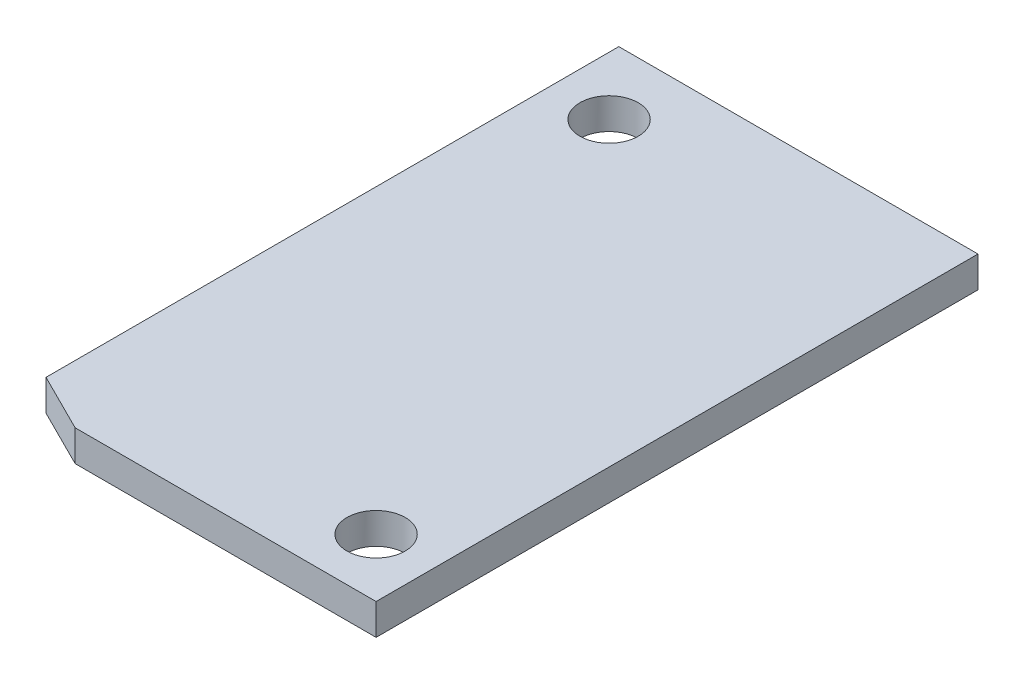
ISO-10303-21;
HEADER;
FILE_DESCRIPTION(('STEP AP214'),'2;1');
FILE_NAME('part.step','',(''),(''),'','','');
FILE_SCHEMA(('AUTOMOTIVE_DESIGN { 1 0 10303 214 1 1 1 1 }'));
ENDSEC;
DATA;
#1=APPLICATION_CONTEXT('core data for automotive mechanical design processes');
#2=APPLICATION_PROTOCOL_DEFINITION('international standard','automotive_design',2000,#1);
#3=PRODUCT_CONTEXT('',#1,'mechanical');
#4=PRODUCT('Part','Part','',(#3));
#5=PRODUCT_RELATED_PRODUCT_CATEGORY('part','',(#4));
#6=PRODUCT_DEFINITION_FORMATION('','',#4);
#7=PRODUCT_DEFINITION_CONTEXT('part definition',#1,'design');
#8=PRODUCT_DEFINITION('design','',#6,#7);
#9=PRODUCT_DEFINITION_SHAPE('','',#8);
#10=(LENGTH_UNIT() NAMED_UNIT(*) SI_UNIT(.MILLI.,.METRE.));
#11=(NAMED_UNIT(*) PLANE_ANGLE_UNIT() SI_UNIT($,.RADIAN.));
#12=(NAMED_UNIT(*) SI_UNIT($,.STERADIAN.) SOLID_ANGLE_UNIT());
#13=UNCERTAINTY_MEASURE_WITH_UNIT(LENGTH_MEASURE(1.E-05),#10,'distance_accuracy_value','');
#14=(GEOMETRIC_REPRESENTATION_CONTEXT(3) GLOBAL_UNCERTAINTY_ASSIGNED_CONTEXT((#13)) GLOBAL_UNIT_ASSIGNED_CONTEXT((#10,
#11,#12)) REPRESENTATION_CONTEXT('',''));
#15=CARTESIAN_POINT('',(0.,0.,0.));
#16=DIRECTION('',(0.,0.,1.));
#17=DIRECTION('',(1.,0.,0.));
#18=AXIS2_PLACEMENT_3D('',#15,#16,#17);
#19=CARTESIAN_POINT('',(9.25,1.6,15.5));
#20=DIRECTION('',(-1.,0.,0.));
#21=DIRECTION('',(0.,0.,1.));
#22=AXIS2_PLACEMENT_3D('',#19,#20,#21);
#23=PLANE('',#22);
#24=DIRECTION('',(0.,0.,-1.));
#25=VECTOR('',#24,1.);
#26=CARTESIAN_POINT('',(9.25,0.,15.5));
#27=LINE('',#26,#25);
#28=CARTESIAN_POINT('',(9.25,0.,15.5));
#29=VERTEX_POINT('',#28);
#30=CARTESIAN_POINT('',(9.25,0.,-15.5));
#31=VERTEX_POINT('',#30);
#32=EDGE_CURVE('E106',#29,#31,#27,.T.);
#33=ORIENTED_EDGE('',*,*,#32,.T.);
#34=DIRECTION('',(0.,-1.,0.));
#35=VECTOR('',#34,1.);
#36=CARTESIAN_POINT('',(9.25,1.6,-15.5));
#37=LINE('',#36,#35);
#38=CARTESIAN_POINT('',(9.25,1.6,-15.5));
#39=VERTEX_POINT('',#38);
#40=EDGE_CURVE('E11',#39,#31,#37,.T.);
#41=ORIENTED_EDGE('',*,*,#40,.F.);
#42=DIRECTION('',(0.,0.,-1.));
#43=VECTOR('',#42,1.);
#44=CARTESIAN_POINT('',(9.25,1.6,15.5));
#45=LINE('',#44,#43);
#46=CARTESIAN_POINT('',(9.25,1.6,15.5));
#47=VERTEX_POINT('',#46);
#48=EDGE_CURVE('E115',#47,#39,#45,.T.);
#49=ORIENTED_EDGE('',*,*,#48,.F.);
#50=DIRECTION('',(0.,-1.,0.));
#51=VECTOR('',#50,1.);
#52=CARTESIAN_POINT('',(9.25,1.6,15.5));
#53=LINE('',#52,#51);
#54=EDGE_CURVE('E102',#47,#29,#53,.T.);
#55=ORIENTED_EDGE('',*,*,#54,.T.);
#56=EDGE_LOOP('',(#33,#41,#49,#55));
#57=FACE_BOUND('',#56,.T.);
#58=ADVANCED_FACE('F31',(#57),#23,.F.);
#59=CARTESIAN_POINT('',(-9.25,1.6,-15.5));
#60=DIRECTION('',(0.,0.,1.));
#61=DIRECTION('',(1.,0.,0.));
#62=AXIS2_PLACEMENT_3D('',#59,#60,#61);
#63=PLANE('',#62);
#64=DIRECTION('',(-1.,0.,0.));
#65=VECTOR('',#64,1.);
#66=CARTESIAN_POINT('',(-9.25,0.,-15.5));
#67=LINE('',#66,#65);
#68=CARTESIAN_POINT('',(-9.25,0.,-15.5));
#69=VERTEX_POINT('',#68);
#70=EDGE_CURVE('E109',#31,#69,#67,.T.);
#71=ORIENTED_EDGE('',*,*,#70,.T.);
#72=DIRECTION('',(0.,-1.,0.));
#73=VECTOR('',#72,1.);
#74=CARTESIAN_POINT('',(-9.25,1.6,-15.5));
#75=LINE('',#74,#73);
#76=CARTESIAN_POINT('',(-9.25,1.6,-15.5));
#77=VERTEX_POINT('',#76);
#78=EDGE_CURVE('E40',#77,#69,#75,.T.);
#79=ORIENTED_EDGE('',*,*,#78,.F.);
#80=DIRECTION('',(-1.,0.,0.));
#81=VECTOR('',#80,1.);
#82=CARTESIAN_POINT('',(-9.25,1.6,-15.5));
#83=LINE('',#82,#81);
#84=EDGE_CURVE('E82',#39,#77,#83,.T.);
#85=ORIENTED_EDGE('',*,*,#84,.F.);
#86=ORIENTED_EDGE('',*,*,#40,.T.);
#87=EDGE_LOOP('',(#71,#79,#85,#86));
#88=FACE_BOUND('',#87,.T.);
#89=ADVANCED_FACE('F136',(#88),#63,.F.);
#90=CARTESIAN_POINT('',(-9.25,1.6,14.));
#91=DIRECTION('',(1.,0.,0.));
#92=DIRECTION('',(0.,0.,-1.));
#93=AXIS2_PLACEMENT_3D('',#90,#91,#92);
#94=PLANE('',#93);
#95=DIRECTION('',(0.,0.,1.));
#96=VECTOR('',#95,1.);
#97=CARTESIAN_POINT('',(-9.25,0.,14.));
#98=LINE('',#97,#96);
#99=CARTESIAN_POINT('',(-9.25,0.,14.));
#100=VERTEX_POINT('',#99);
#101=EDGE_CURVE('E97',#69,#100,#98,.T.);
#102=ORIENTED_EDGE('',*,*,#101,.T.);
#103=DIRECTION('',(0.,-1.,0.));
#104=VECTOR('',#103,1.);
#105=CARTESIAN_POINT('',(-9.25,1.6,14.));
#106=LINE('',#105,#104);
#107=CARTESIAN_POINT('',(-9.25,1.6,14.));
#108=VERTEX_POINT('',#107);
#109=EDGE_CURVE('E94',#108,#100,#106,.T.);
#110=ORIENTED_EDGE('',*,*,#109,.F.);
#111=DIRECTION('',(0.,0.,1.));
#112=VECTOR('',#111,1.);
#113=CARTESIAN_POINT('',(-9.25,1.6,14.));
#114=LINE('',#113,#112);
#115=EDGE_CURVE('E86',#77,#108,#114,.T.);
#116=ORIENTED_EDGE('',*,*,#115,.F.);
#117=ORIENTED_EDGE('',*,*,#78,.T.);
#118=EDGE_LOOP('',(#102,#110,#116,#117));
#119=FACE_BOUND('',#118,.T.);
#120=ADVANCED_FACE('F95',(#119),#94,.F.);
#121=CARTESIAN_POINT('',(-9.25,1.6,14.));
#122=DIRECTION('',(0.447213595499958,0.,-0.894427190999916));
#123=DIRECTION('',(-0.894427190999916,0.,-0.447213595499958));
#124=AXIS2_PLACEMENT_3D('',#121,#122,#123);
#125=PLANE('',#124);
#126=DIRECTION('',(0.894427190999916,0.,0.447213595499958));
#127=VECTOR('',#126,1.);
#128=CARTESIAN_POINT('',(-9.25,0.,14.));
#129=LINE('',#128,#127);
#130=CARTESIAN_POINT('',(-6.25,0.,15.5));
#131=VERTEX_POINT('',#130);
#132=EDGE_CURVE('E68',#100,#131,#129,.T.);
#133=ORIENTED_EDGE('',*,*,#132,.T.);
#134=DIRECTION('',(0.,-1.,0.));
#135=VECTOR('',#134,1.);
#136=CARTESIAN_POINT('',(-6.25,1.6,15.5));
#137=LINE('',#136,#135);
#138=CARTESIAN_POINT('',(-6.25,1.6,15.5));
#139=VERTEX_POINT('',#138);
#140=EDGE_CURVE('E98',#139,#131,#137,.T.);
#141=ORIENTED_EDGE('',*,*,#140,.F.);
#142=DIRECTION('',(0.894427190999916,0.,0.447213595499958));
#143=VECTOR('',#142,1.);
#144=CARTESIAN_POINT('',(-9.25,1.6,14.));
#145=LINE('',#144,#143);
#146=EDGE_CURVE('E90',#108,#139,#145,.T.);
#147=ORIENTED_EDGE('',*,*,#146,.F.);
#148=ORIENTED_EDGE('',*,*,#109,.T.);
#149=EDGE_LOOP('',(#133,#141,#147,#148));
#150=FACE_BOUND('',#149,.T.);
#151=ADVANCED_FACE('F100',(#150),#125,.F.);
#152=CARTESIAN_POINT('',(-6.25,1.6,15.5));
#153=DIRECTION('',(0.,0.,-1.));
#154=DIRECTION('',(-1.,0.,0.));
#155=AXIS2_PLACEMENT_3D('',#152,#153,#154);
#156=PLANE('',#155);
#157=DIRECTION('',(1.,0.,0.));
#158=VECTOR('',#157,1.);
#159=CARTESIAN_POINT('',(-6.25,0.,15.5));
#160=LINE('',#159,#158);
#161=EDGE_CURVE('E74',#131,#29,#160,.T.);
#162=ORIENTED_EDGE('',*,*,#161,.T.);
#163=ORIENTED_EDGE('',*,*,#54,.F.);
#164=DIRECTION('',(1.,0.,0.));
#165=VECTOR('',#164,1.);
#166=CARTESIAN_POINT('',(-6.25,1.6,15.5));
#167=LINE('',#166,#165);
#168=EDGE_CURVE('E48',#139,#47,#167,.T.);
#169=ORIENTED_EDGE('',*,*,#168,.F.);
#170=ORIENTED_EDGE('',*,*,#140,.T.);
#171=EDGE_LOOP('',(#162,#163,#169,#170));
#172=FACE_BOUND('',#171,.T.);
#173=ADVANCED_FACE('F124',(#172),#156,.F.);
#174=CARTESIAN_POINT('',(9.25,1.6,-15.5));
#175=DIRECTION('',(0.,-1.,0.));
#176=DIRECTION('',(0.,0.,-1.));
#177=AXIS2_PLACEMENT_3D('',#174,#175,#176);
#178=PLANE('',#177);
#179=CARTESIAN_POINT('',(6.25,1.6,12.5));
#180=DIRECTION('',(0.,1.,0.));
#181=DIRECTION('',(0.,0.,1.));
#182=AXIS2_PLACEMENT_3D('',#179,#180,#181);
#183=CIRCLE('',#182,1.49999999999999);
#184=CARTESIAN_POINT('',(6.25,1.6,14.));
#185=VERTEX_POINT('',#184);
#186=EDGE_CURVE('E197',#185,#185,#183,.T.);
#187=ORIENTED_EDGE('',*,*,#186,.F.);
#188=EDGE_LOOP('',(#187));
#189=FACE_BOUND('',#188,.T.);
#190=CARTESIAN_POINT('',(-6.25,1.6,-12.));
#191=DIRECTION('',(0.,1.,0.));
#192=DIRECTION('',(0.,0.,1.));
#193=AXIS2_PLACEMENT_3D('',#190,#191,#192);
#194=CIRCLE('',#193,1.49999999999999);
#195=CARTESIAN_POINT('',(-6.25,1.6,-10.5));
#196=VERTEX_POINT('',#195);
#197=EDGE_CURVE('E199',#196,#196,#194,.T.);
#198=ORIENTED_EDGE('',*,*,#197,.F.);
#199=EDGE_LOOP('',(#198));
#200=FACE_BOUND('',#199,.T.);
#201=ORIENTED_EDGE('',*,*,#48,.T.);
#202=ORIENTED_EDGE('',*,*,#84,.T.);
#203=ORIENTED_EDGE('',*,*,#115,.T.);
#204=ORIENTED_EDGE('',*,*,#146,.T.);
#205=ORIENTED_EDGE('',*,*,#168,.T.);
#206=EDGE_LOOP('',(#201,#202,#203,#204,#205));
#207=FACE_BOUND('',#206,.T.);
#208=ADVANCED_FACE('F88',(#189,#200,#207),#178,.F.);
#209=CARTESIAN_POINT('',(9.25,0.,-15.5));
#210=DIRECTION('',(0.,-1.,0.));
#211=DIRECTION('',(0.,0.,-1.));
#212=AXIS2_PLACEMENT_3D('',#209,#210,#211);
#213=PLANE('',#212);
#214=CARTESIAN_POINT('',(6.25,0.,12.5));
#215=DIRECTION('',(0.,-1.,0.));
#216=DIRECTION('',(0.,0.,-1.));
#217=AXIS2_PLACEMENT_3D('',#214,#215,#216);
#218=CIRCLE('',#217,1.49999999999999);
#219=CARTESIAN_POINT('',(6.25,0.,11.));
#220=VERTEX_POINT('',#219);
#221=EDGE_CURVE('E34',#220,#220,#218,.T.);
#222=ORIENTED_EDGE('',*,*,#221,.F.);
#223=EDGE_LOOP('',(#222));
#224=FACE_BOUND('',#223,.T.);
#225=CARTESIAN_POINT('',(-6.25,0.,-12.));
#226=DIRECTION('',(0.,-1.,0.));
#227=DIRECTION('',(0.,0.,-1.));
#228=AXIS2_PLACEMENT_3D('',#225,#226,#227);
#229=CIRCLE('',#228,1.49999999999999);
#230=CARTESIAN_POINT('',(-6.25,0.,-13.5));
#231=VERTEX_POINT('',#230);
#232=EDGE_CURVE('E110',#231,#231,#229,.T.);
#233=ORIENTED_EDGE('',*,*,#232,.F.);
#234=EDGE_LOOP('',(#233));
#235=FACE_BOUND('',#234,.T.);
#236=ORIENTED_EDGE('',*,*,#32,.F.);
#237=ORIENTED_EDGE('',*,*,#161,.F.);
#238=ORIENTED_EDGE('',*,*,#132,.F.);
#239=ORIENTED_EDGE('',*,*,#101,.F.);
#240=ORIENTED_EDGE('',*,*,#70,.F.);
#241=EDGE_LOOP('',(#236,#237,#238,#239,#240));
#242=FACE_BOUND('',#241,.T.);
#243=ADVANCED_FACE('F120',(#224,#235,#242),#213,.T.);
#244=CARTESIAN_POINT('',(-6.25,1.6,-12.));
#245=DIRECTION('',(0.,1.,0.));
#246=DIRECTION('',(0.,0.,1.));
#247=AXIS2_PLACEMENT_3D('',#244,#245,#246);
#248=CYLINDRICAL_SURFACE('',#247,1.49999999999999);
#249=ORIENTED_EDGE('',*,*,#232,.T.);
#250=EDGE_LOOP('',(#249));
#251=FACE_BOUND('',#250,.T.);
#252=ORIENTED_EDGE('',*,*,#197,.T.);
#253=EDGE_LOOP('',(#252));
#254=FACE_BOUND('',#253,.T.);
#255=ADVANCED_FACE('F169',(#251,#254),#248,.F.);
#256=CARTESIAN_POINT('',(6.25,1.6,12.5));
#257=DIRECTION('',(0.,1.,0.));
#258=DIRECTION('',(0.,0.,1.));
#259=AXIS2_PLACEMENT_3D('',#256,#257,#258);
#260=CYLINDRICAL_SURFACE('',#259,1.49999999999999);
#261=ORIENTED_EDGE('',*,*,#221,.T.);
#262=EDGE_LOOP('',(#261));
#263=FACE_BOUND('',#262,.T.);
#264=ORIENTED_EDGE('',*,*,#186,.T.);
#265=EDGE_LOOP('',(#264));
#266=FACE_BOUND('',#265,.T.);
#267=ADVANCED_FACE('F178',(#263,#266),#260,.F.);
#268=CLOSED_SHELL('',(#58,#89,#120,#151,#173,#208,#243,#255,#267));
#269=MANIFOLD_SOLID_BREP('B2',#268);
#270=ADVANCED_BREP_SHAPE_REPRESENTATION('',(#18,#269),#14);
#271=SHAPE_DEFINITION_REPRESENTATION(#9,#270);
ENDSEC;
END-ISO-10303-21;
